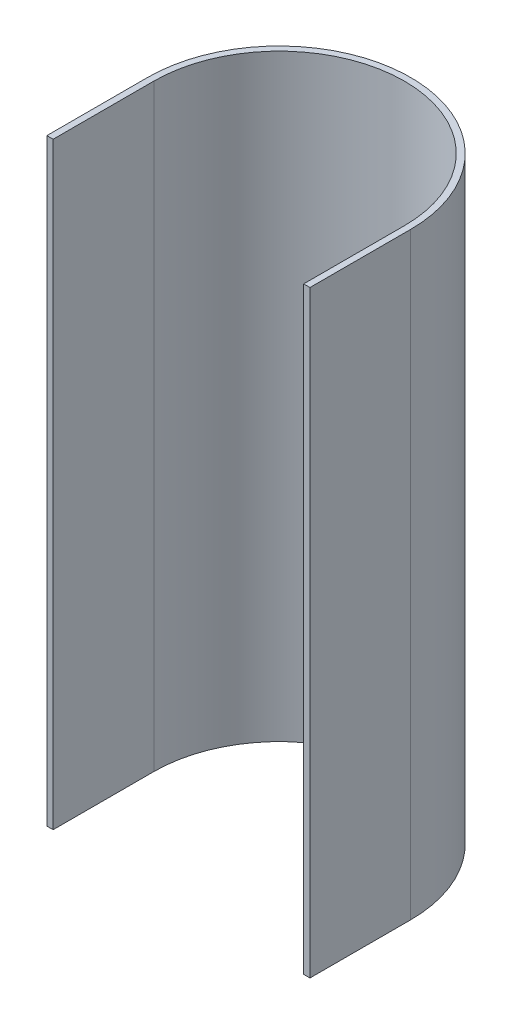
ISO-10303-21;
HEADER;
FILE_DESCRIPTION(('STEP AP214'),'2;1');
FILE_NAME('part.step','',(''),(''),'','','');
FILE_SCHEMA(('AUTOMOTIVE_DESIGN { 1 0 10303 214 1 1 1 1 }'));
ENDSEC;
DATA;
#1=APPLICATION_CONTEXT('core data for automotive mechanical design processes');
#2=APPLICATION_PROTOCOL_DEFINITION('international standard','automotive_design',2000,#1);
#3=PRODUCT_CONTEXT('',#1,'mechanical');
#4=PRODUCT('Part','Part','',(#3));
#5=PRODUCT_RELATED_PRODUCT_CATEGORY('part','',(#4));
#6=PRODUCT_DEFINITION_FORMATION('','',#4);
#7=PRODUCT_DEFINITION_CONTEXT('part definition',#1,'design');
#8=PRODUCT_DEFINITION('design','',#6,#7);
#9=PRODUCT_DEFINITION_SHAPE('','',#8);
#10=(LENGTH_UNIT() NAMED_UNIT(*) SI_UNIT(.MILLI.,.METRE.));
#11=(NAMED_UNIT(*) PLANE_ANGLE_UNIT() SI_UNIT($,.RADIAN.));
#12=(NAMED_UNIT(*) SI_UNIT($,.STERADIAN.) SOLID_ANGLE_UNIT());
#13=UNCERTAINTY_MEASURE_WITH_UNIT(LENGTH_MEASURE(1.E-05),#10,'distance_accuracy_value','');
#14=(GEOMETRIC_REPRESENTATION_CONTEXT(3) GLOBAL_UNCERTAINTY_ASSIGNED_CONTEXT((#13)) GLOBAL_UNIT_ASSIGNED_CONTEXT((#10,
#11,#12)) REPRESENTATION_CONTEXT('',''));
#15=CARTESIAN_POINT('',(0.,0.,0.));
#16=DIRECTION('',(0.,0.,1.));
#17=DIRECTION('',(1.,0.,0.));
#18=AXIS2_PLACEMENT_3D('',#15,#16,#17);
#19=CARTESIAN_POINT('',(30.8893294803399,18.,0.));
#20=DIRECTION('',(1.,0.,0.));
#21=DIRECTION('',(0.,0.,-1.));
#22=AXIS2_PLACEMENT_3D('',#19,#20,#21);
#23=PLANE('',#22);
#24=DIRECTION('',(0.,-1.,0.));
#25=VECTOR('',#24,1.);
#26=CARTESIAN_POINT('',(30.8893294803399,18.,0.2));
#27=LINE('',#26,#25);
#28=CARTESIAN_POINT('',(30.8893294803399,18.,0.2));
#29=VERTEX_POINT('',#28);
#30=CARTESIAN_POINT('',(30.8893294803399,-1.,0.2));
#31=VERTEX_POINT('',#30);
#32=EDGE_CURVE('E109',#29,#31,#27,.T.);
#33=ORIENTED_EDGE('',*,*,#32,.T.);
#34=DIRECTION('',(0.,0.,1.));
#35=VECTOR('',#34,1.);
#36=CARTESIAN_POINT('',(30.8893294803399,-1.,0.));
#37=LINE('',#36,#35);
#38=CARTESIAN_POINT('',(30.8893294803399,-1.,-3.));
#39=VERTEX_POINT('',#38);
#40=EDGE_CURVE('E108',#39,#31,#37,.T.);
#41=ORIENTED_EDGE('',*,*,#40,.F.);
#42=DIRECTION('',(0.,-1.,0.));
#43=VECTOR('',#42,1.);
#44=CARTESIAN_POINT('',(30.8893294803399,18.,-3.));
#45=LINE('',#44,#43);
#46=CARTESIAN_POINT('',(30.8893294803399,18.,-3.));
#47=VERTEX_POINT('',#46);
#48=EDGE_CURVE('E11',#47,#39,#45,.T.);
#49=ORIENTED_EDGE('',*,*,#48,.F.);
#50=DIRECTION('',(0.,0.,1.));
#51=VECTOR('',#50,1.);
#52=CARTESIAN_POINT('',(30.8893294803399,18.,0.));
#53=LINE('',#52,#51);
#54=EDGE_CURVE('E135',#47,#29,#53,.T.);
#55=ORIENTED_EDGE('',*,*,#54,.T.);
#56=EDGE_LOOP('',(#33,#41,#49,#55));
#57=FACE_BOUND('',#56,.T.);
#58=ADVANCED_FACE('F35',(#57),#23,.T.);
#59=CARTESIAN_POINT('',(26.7093294803399,18.,-3.));
#60=DIRECTION('',(0.,-1.,0.));
#61=DIRECTION('',(0.,0.,-1.));
#62=AXIS2_PLACEMENT_3D('',#59,#60,#61);
#63=CYLINDRICAL_SURFACE('',#62,4.18);
#64=ORIENTED_EDGE('',*,*,#48,.T.);
#65=CARTESIAN_POINT('',(26.7093294803399,-1.,-3.));
#66=DIRECTION('',(0.,1.,0.));
#67=DIRECTION('',(0.,0.,1.));
#68=AXIS2_PLACEMENT_3D('',#65,#66,#67);
#69=CIRCLE('',#68,4.18);
#70=CARTESIAN_POINT('',(22.5293294803399,-1.,-3.));
#71=VERTEX_POINT('',#70);
#72=EDGE_CURVE('E103',#39,#71,#69,.T.);
#73=ORIENTED_EDGE('',*,*,#72,.T.);
#74=DIRECTION('',(0.,-1.,0.));
#75=VECTOR('',#74,1.);
#76=CARTESIAN_POINT('',(22.5293294803399,18.,-3.));
#77=LINE('',#76,#75);
#78=CARTESIAN_POINT('',(22.5293294803399,18.,-3.));
#79=VERTEX_POINT('',#78);
#80=EDGE_CURVE('E42',#79,#71,#77,.T.);
#81=ORIENTED_EDGE('',*,*,#80,.F.);
#82=CARTESIAN_POINT('',(26.7093294803399,18.,-3.));
#83=DIRECTION('',(0.,1.,0.));
#84=DIRECTION('',(0.,0.,1.));
#85=AXIS2_PLACEMENT_3D('',#82,#83,#84);
#86=CIRCLE('',#85,4.18);
#87=EDGE_CURVE('E104',#47,#79,#86,.T.);
#88=ORIENTED_EDGE('',*,*,#87,.F.);
#89=EDGE_LOOP('',(#64,#73,#81,#88));
#90=FACE_BOUND('',#89,.T.);
#91=ADVANCED_FACE('F100',(#90),#63,.T.);
#92=CARTESIAN_POINT('',(22.5293294803399,18.,0.));
#93=DIRECTION('',(1.,0.,0.));
#94=DIRECTION('',(0.,0.,-1.));
#95=AXIS2_PLACEMENT_3D('',#92,#93,#94);
#96=PLANE('',#95);
#97=ORIENTED_EDGE('',*,*,#80,.T.);
#98=DIRECTION('',(0.,0.,1.));
#99=VECTOR('',#98,1.);
#100=CARTESIAN_POINT('',(22.5293294803399,-1.,0.));
#101=LINE('',#100,#99);
#102=CARTESIAN_POINT('',(22.5293294803399,-1.,0.2));
#103=VERTEX_POINT('',#102);
#104=EDGE_CURVE('E118',#71,#103,#101,.T.);
#105=ORIENTED_EDGE('',*,*,#104,.T.);
#106=DIRECTION('',(0.,-1.,0.));
#107=VECTOR('',#106,1.);
#108=CARTESIAN_POINT('',(22.5293294803399,18.,0.2));
#109=LINE('',#108,#107);
#110=CARTESIAN_POINT('',(22.5293294803399,18.,0.2));
#111=VERTEX_POINT('',#110);
#112=EDGE_CURVE('E158',#111,#103,#109,.T.);
#113=ORIENTED_EDGE('',*,*,#112,.F.);
#114=DIRECTION('',(0.,0.,1.));
#115=VECTOR('',#114,1.);
#116=CARTESIAN_POINT('',(22.5293294803399,18.,0.));
#117=LINE('',#116,#115);
#118=EDGE_CURVE('E138',#79,#111,#117,.T.);
#119=ORIENTED_EDGE('',*,*,#118,.F.);
#120=EDGE_LOOP('',(#97,#105,#113,#119));
#121=FACE_BOUND('',#120,.T.);
#122=ADVANCED_FACE('F161',(#121),#96,.F.);
#123=CARTESIAN_POINT('',(0.,18.,0.2));
#124=DIRECTION('',(0.,0.,-1.));
#125=DIRECTION('',(-1.,0.,0.));
#126=AXIS2_PLACEMENT_3D('',#123,#124,#125);
#127=PLANE('',#126);
#128=ORIENTED_EDGE('',*,*,#112,.T.);
#129=DIRECTION('',(1.,0.,0.));
#130=VECTOR('',#129,1.);
#131=CARTESIAN_POINT('',(0.,-1.,0.2));
#132=LINE('',#131,#130);
#133=CARTESIAN_POINT('',(22.7293294803399,-1.,0.2));
#134=VERTEX_POINT('',#133);
#135=EDGE_CURVE('E120',#103,#134,#132,.T.);
#136=ORIENTED_EDGE('',*,*,#135,.T.);
#137=DIRECTION('',(0.,-1.,0.));
#138=VECTOR('',#137,1.);
#139=CARTESIAN_POINT('',(22.7293294803399,18.,0.2));
#140=LINE('',#139,#138);
#141=CARTESIAN_POINT('',(22.7293294803399,18.,0.2));
#142=VERTEX_POINT('',#141);
#143=EDGE_CURVE('E156',#142,#134,#140,.T.);
#144=ORIENTED_EDGE('',*,*,#143,.F.);
#145=DIRECTION('',(1.,0.,0.));
#146=VECTOR('',#145,1.);
#147=CARTESIAN_POINT('',(0.,18.,0.2));
#148=LINE('',#147,#146);
#149=EDGE_CURVE('E140',#111,#142,#148,.T.);
#150=ORIENTED_EDGE('',*,*,#149,.F.);
#151=EDGE_LOOP('',(#128,#136,#144,#150));
#152=FACE_BOUND('',#151,.T.);
#153=ADVANCED_FACE('F168',(#152),#127,.F.);
#154=CARTESIAN_POINT('',(22.7293294803399,18.,0.));
#155=DIRECTION('',(1.,0.,0.));
#156=DIRECTION('',(0.,0.,-1.));
#157=AXIS2_PLACEMENT_3D('',#154,#155,#156);
#158=PLANE('',#157);
#159=ORIENTED_EDGE('',*,*,#143,.T.);
#160=DIRECTION('',(0.,0.,1.));
#161=VECTOR('',#160,1.);
#162=CARTESIAN_POINT('',(22.7293294803399,-1.,0.));
#163=LINE('',#162,#161);
#164=CARTESIAN_POINT('',(22.7293294803399,-1.,-3.));
#165=VERTEX_POINT('',#164);
#166=EDGE_CURVE('E125',#165,#134,#163,.T.);
#167=ORIENTED_EDGE('',*,*,#166,.F.);
#168=DIRECTION('',(0.,-1.,0.));
#169=VECTOR('',#168,1.);
#170=CARTESIAN_POINT('',(22.7293294803399,18.,-3.));
#171=LINE('',#170,#169);
#172=CARTESIAN_POINT('',(22.7293294803399,18.,-3.));
#173=VERTEX_POINT('',#172);
#174=EDGE_CURVE('E154',#173,#165,#171,.T.);
#175=ORIENTED_EDGE('',*,*,#174,.F.);
#176=DIRECTION('',(0.,0.,1.));
#177=VECTOR('',#176,1.);
#178=CARTESIAN_POINT('',(22.7293294803399,18.,0.));
#179=LINE('',#178,#177);
#180=EDGE_CURVE('E142',#173,#142,#179,.T.);
#181=ORIENTED_EDGE('',*,*,#180,.T.);
#182=EDGE_LOOP('',(#159,#167,#175,#181));
#183=FACE_BOUND('',#182,.T.);
#184=ADVANCED_FACE('F171',(#183),#158,.T.);
#185=CARTESIAN_POINT('',(26.7093294803399,18.,-3.));
#186=DIRECTION('',(0.,-1.,0.));
#187=DIRECTION('',(0.,0.,-1.));
#188=AXIS2_PLACEMENT_3D('',#185,#186,#187);
#189=CYLINDRICAL_SURFACE('',#188,3.98);
#190=ORIENTED_EDGE('',*,*,#174,.T.);
#191=CARTESIAN_POINT('',(26.7093294803399,-1.,-3.));
#192=DIRECTION('',(0.,1.,0.));
#193=DIRECTION('',(0.,0.,1.));
#194=AXIS2_PLACEMENT_3D('',#191,#192,#193);
#195=CIRCLE('',#194,3.98);
#196=CARTESIAN_POINT('',(30.6893294803399,-1.,-3.));
#197=VERTEX_POINT('',#196);
#198=EDGE_CURVE('E129',#197,#165,#195,.T.);
#199=ORIENTED_EDGE('',*,*,#198,.F.);
#200=DIRECTION('',(0.,-1.,0.));
#201=VECTOR('',#200,1.);
#202=CARTESIAN_POINT('',(30.6893294803399,18.,-3.));
#203=LINE('',#202,#201);
#204=CARTESIAN_POINT('',(30.6893294803399,18.,-3.));
#205=VERTEX_POINT('',#204);
#206=EDGE_CURVE('E152',#205,#197,#203,.T.);
#207=ORIENTED_EDGE('',*,*,#206,.F.);
#208=CARTESIAN_POINT('',(26.7093294803399,18.,-3.));
#209=DIRECTION('',(0.,1.,0.));
#210=DIRECTION('',(0.,0.,1.));
#211=AXIS2_PLACEMENT_3D('',#208,#209,#210);
#212=CIRCLE('',#211,3.98);
#213=EDGE_CURVE('E145',#205,#173,#212,.T.);
#214=ORIENTED_EDGE('',*,*,#213,.T.);
#215=EDGE_LOOP('',(#190,#199,#207,#214));
#216=FACE_BOUND('',#215,.T.);
#217=ADVANCED_FACE('F174',(#216),#189,.F.);
#218=CARTESIAN_POINT('',(30.6893294803399,18.,0.));
#219=DIRECTION('',(1.,0.,0.));
#220=DIRECTION('',(0.,0.,-1.));
#221=AXIS2_PLACEMENT_3D('',#218,#219,#220);
#222=PLANE('',#221);
#223=ORIENTED_EDGE('',*,*,#206,.T.);
#224=DIRECTION('',(0.,0.,1.));
#225=VECTOR('',#224,1.);
#226=CARTESIAN_POINT('',(30.6893294803399,-1.,0.));
#227=LINE('',#226,#225);
#228=CARTESIAN_POINT('',(30.6893294803399,-1.,0.2));
#229=VERTEX_POINT('',#228);
#230=EDGE_CURVE('E132',#197,#229,#227,.T.);
#231=ORIENTED_EDGE('',*,*,#230,.T.);
#232=DIRECTION('',(0.,-1.,0.));
#233=VECTOR('',#232,1.);
#234=CARTESIAN_POINT('',(30.6893294803399,18.,0.2));
#235=LINE('',#234,#233);
#236=CARTESIAN_POINT('',(30.6893294803399,18.,0.2));
#237=VERTEX_POINT('',#236);
#238=EDGE_CURVE('E150',#237,#229,#235,.T.);
#239=ORIENTED_EDGE('',*,*,#238,.F.);
#240=DIRECTION('',(0.,0.,1.));
#241=VECTOR('',#240,1.);
#242=CARTESIAN_POINT('',(30.6893294803399,18.,0.));
#243=LINE('',#242,#241);
#244=EDGE_CURVE('E54',#205,#237,#243,.T.);
#245=ORIENTED_EDGE('',*,*,#244,.F.);
#246=EDGE_LOOP('',(#223,#231,#239,#245));
#247=FACE_BOUND('',#246,.T.);
#248=ADVANCED_FACE('F177',(#247),#222,.F.);
#249=ORIENTED_EDGE('',*,*,#238,.T.);
#250=EDGE_CURVE('E126',#229,#31,#132,.T.);
#251=ORIENTED_EDGE('',*,*,#250,.T.);
#252=ORIENTED_EDGE('',*,*,#32,.F.);
#253=EDGE_CURVE('E49',#237,#29,#148,.T.);
#254=ORIENTED_EDGE('',*,*,#253,.F.);
#255=EDGE_LOOP('',(#249,#251,#252,#254));
#256=FACE_BOUND('',#255,.T.);
#257=ADVANCED_FACE('F179',(#256),#127,.F.);
#258=CARTESIAN_POINT('',(0.,18.,0.));
#259=DIRECTION('',(0.,1.,0.));
#260=DIRECTION('',(0.,0.,1.));
#261=AXIS2_PLACEMENT_3D('',#258,#259,#260);
#262=PLANE('',#261);
#263=ORIENTED_EDGE('',*,*,#54,.F.);
#264=ORIENTED_EDGE('',*,*,#87,.T.);
#265=ORIENTED_EDGE('',*,*,#118,.T.);
#266=ORIENTED_EDGE('',*,*,#149,.T.);
#267=ORIENTED_EDGE('',*,*,#180,.F.);
#268=ORIENTED_EDGE('',*,*,#213,.F.);
#269=ORIENTED_EDGE('',*,*,#244,.T.);
#270=ORIENTED_EDGE('',*,*,#253,.T.);
#271=EDGE_LOOP('',(#263,#264,#265,#266,#267,#268,#269,#270));
#272=FACE_BOUND('',#271,.T.);
#273=ADVANCED_FACE('F164',(#272),#262,.T.);
#274=CARTESIAN_POINT('',(0.,-1.,0.));
#275=DIRECTION('',(0.,1.,0.));
#276=DIRECTION('',(0.,0.,1.));
#277=AXIS2_PLACEMENT_3D('',#274,#275,#276);
#278=PLANE('',#277);
#279=ORIENTED_EDGE('',*,*,#40,.T.);
#280=ORIENTED_EDGE('',*,*,#250,.F.);
#281=ORIENTED_EDGE('',*,*,#230,.F.);
#282=ORIENTED_EDGE('',*,*,#198,.T.);
#283=ORIENTED_EDGE('',*,*,#166,.T.);
#284=ORIENTED_EDGE('',*,*,#135,.F.);
#285=ORIENTED_EDGE('',*,*,#104,.F.);
#286=ORIENTED_EDGE('',*,*,#72,.F.);
#287=EDGE_LOOP('',(#279,#280,#281,#282,#283,#284,#285,#286));
#288=FACE_BOUND('',#287,.T.);
#289=ADVANCED_FACE('F115',(#288),#278,.F.);
#290=CLOSED_SHELL('',(#58,#91,#122,#153,#184,#217,#248,#257,#273,#289));
#291=MANIFOLD_SOLID_BREP('B2',#290);
#292=ADVANCED_BREP_SHAPE_REPRESENTATION('',(#18,#291),#14);
#293=SHAPE_DEFINITION_REPRESENTATION(#9,#292);
ENDSEC;
END-ISO-10303-21;
